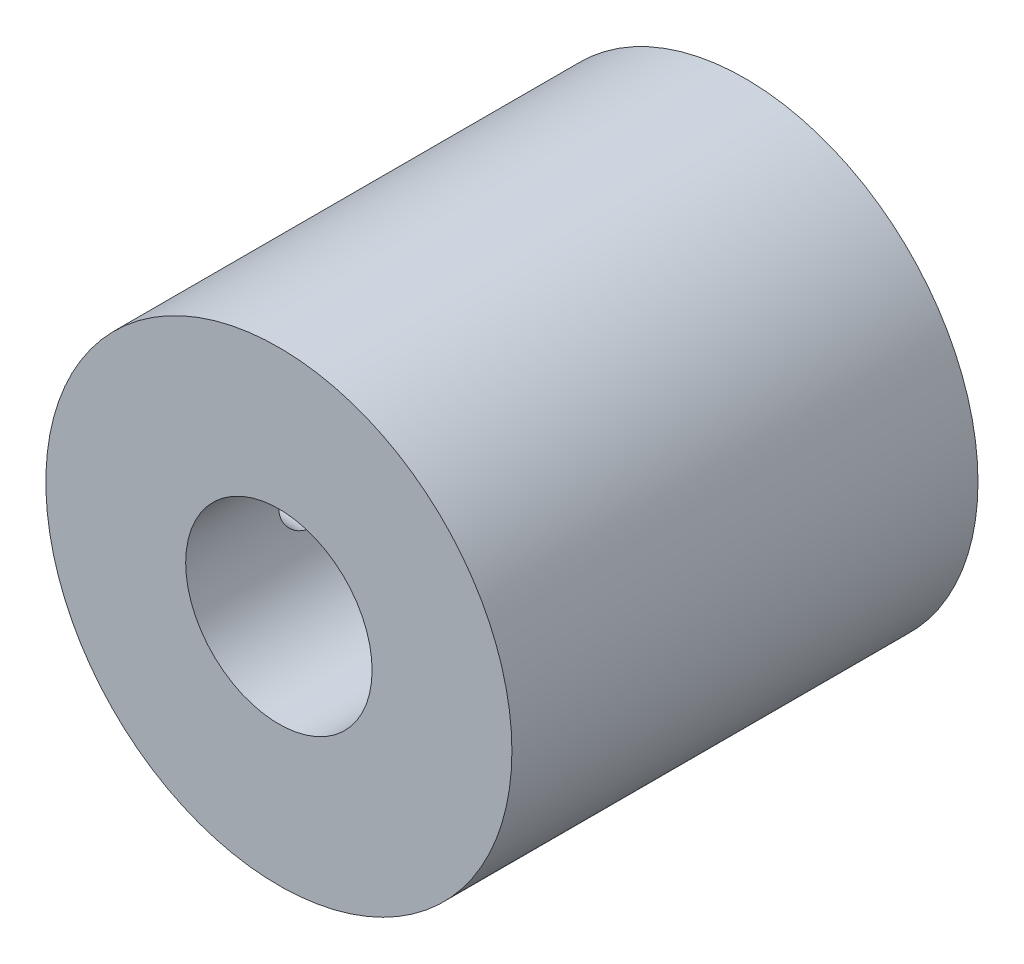
ISO-10303-21;
HEADER;
FILE_DESCRIPTION(('STEP AP214'),'2;1');
FILE_NAME('part.step','',(''),(''),'','','');
FILE_SCHEMA(('AUTOMOTIVE_DESIGN { 1 0 10303 214 1 1 1 1 }'));
ENDSEC;
DATA;
#1=APPLICATION_CONTEXT('core data for automotive mechanical design processes');
#2=APPLICATION_PROTOCOL_DEFINITION('international standard','automotive_design',2000,#1);
#3=PRODUCT_CONTEXT('',#1,'mechanical');
#4=PRODUCT('Part','Part','',(#3));
#5=PRODUCT_RELATED_PRODUCT_CATEGORY('part','',(#4));
#6=PRODUCT_DEFINITION_FORMATION('','',#4);
#7=PRODUCT_DEFINITION_CONTEXT('part definition',#1,'design');
#8=PRODUCT_DEFINITION('design','',#6,#7);
#9=PRODUCT_DEFINITION_SHAPE('','',#8);
#10=(LENGTH_UNIT() NAMED_UNIT(*) SI_UNIT(.MILLI.,.METRE.));
#11=(NAMED_UNIT(*) PLANE_ANGLE_UNIT() SI_UNIT($,.RADIAN.));
#12=(NAMED_UNIT(*) SI_UNIT($,.STERADIAN.) SOLID_ANGLE_UNIT());
#13=UNCERTAINTY_MEASURE_WITH_UNIT(LENGTH_MEASURE(1.E-05),#10,'distance_accuracy_value','');
#14=(GEOMETRIC_REPRESENTATION_CONTEXT(3) GLOBAL_UNCERTAINTY_ASSIGNED_CONTEXT((#13)) GLOBAL_UNIT_ASSIGNED_CONTEXT((#10,
#11,#12)) REPRESENTATION_CONTEXT('',''));
#15=CARTESIAN_POINT('',(0.,0.,0.));
#16=DIRECTION('',(0.,0.,1.));
#17=DIRECTION('',(1.,0.,0.));
#18=AXIS2_PLACEMENT_3D('',#15,#16,#17);
#19=CARTESIAN_POINT('',(0.,0.,12.5));
#20=DIRECTION('',(0.,0.,-1.));
#21=DIRECTION('',(-1.,0.,0.));
#22=AXIS2_PLACEMENT_3D('',#19,#20,#21);
#23=CYLINDRICAL_SURFACE('',#22,12.5);
#24=CARTESIAN_POINT('',(-12.5,0.,4.5));
#25=CARTESIAN_POINT('',(-12.499998867873,-0.0839320235538505,4.50000358197072));
#26=CARTESIAN_POINT('',(-12.4991457100204,-0.167917158665596,4.50706832934634));
#27=CARTESIAN_POINT('',(-12.495824352711,-0.333552285654126,4.53514053207769));
#28=CARTESIAN_POINT('',(-12.4933544466864,-0.415199714795035,4.55616272062529));
#29=CARTESIAN_POINT('',(-12.4870779632713,-0.573737397670265,4.61152313826301));
#30=CARTESIAN_POINT('',(-12.4832722657654,-0.650630743796125,4.64585260341209));
#31=CARTESIAN_POINT('',(-12.4747479632173,-0.797549578916002,4.72683436754165));
#32=CARTESIAN_POINT('',(-12.4700295202071,-0.86757628356758,4.77348447987666));
#33=CARTESIAN_POINT('',(-12.460180052721,-0.999145657672257,4.87803743098762));
#34=CARTESIAN_POINT('',(-12.4550472515452,-1.0606483456536,4.93599042005596));
#35=CARTESIAN_POINT('',(-12.4449619698576,-1.17307965519171,5.06139648244395));
#36=CARTESIAN_POINT('',(-12.4400094983534,-1.22400774913237,5.12885002950932));
#37=CARTESIAN_POINT('',(-12.4308280185202,-1.31399171436948,5.27160041264919));
#38=CARTESIAN_POINT('',(-12.4266012951985,-1.35301037836285,5.34692086229007));
#39=CARTESIAN_POINT('',(-12.4193730672343,-1.4178302865078,5.50310435105437));
#40=CARTESIAN_POINT('',(-12.4163715196899,-1.44363199348388,5.58396719598465));
#41=CARTESIAN_POINT('',(-12.4119503036869,-1.481164650227,5.74852642965571));
#42=CARTESIAN_POINT('',(-12.4105230726271,-1.49296288993823,5.83220726421384));
#43=CARTESIAN_POINT('',(-12.4093888845306,-1.50236187609835,6.00037246818208));
#44=CARTESIAN_POINT('',(-12.4096818635516,-1.49996315026424,6.08485680760848));
#45=CARTESIAN_POINT('',(-12.4119480733153,-1.48109158039334,6.25176298239218));
#46=CARTESIAN_POINT('',(-12.4139124717338,-1.46469271611151,6.33419331934009));
#47=CARTESIAN_POINT('',(-12.4192864043804,-1.41840173085034,6.49512351391068));
#48=CARTESIAN_POINT('',(-12.4226959657844,-1.38850935612907,6.5736232975895));
#49=CARTESIAN_POINT('',(-12.4305861039738,-1.31599990349931,6.72469473411956));
#50=CARTESIAN_POINT('',(-12.4350693931099,-1.27335053101963,6.79725073917678));
#51=CARTESIAN_POINT('',(-12.444599699395,-1.17656086584735,6.93420360545788));
#52=CARTESIAN_POINT('',(-12.4496467403106,-1.12242008861578,6.99860012245129));
#53=CARTESIAN_POINT('',(-12.4597751654319,-1.0037737778109,7.11783554218219));
#54=CARTESIAN_POINT('',(-12.464856563712,-0.93920445025608,7.17261098492853));
#55=CARTESIAN_POINT('',(-12.4744510399275,-0.801753979469361,7.27055576050016));
#56=CARTESIAN_POINT('',(-12.478964116721,-0.728872819540024,7.31372507000958));
#57=CARTESIAN_POINT('',(-12.4869159430851,-0.576819654131424,7.38723164281983));
#58=CARTESIAN_POINT('',(-12.4903543736405,-0.497645789357797,7.41756509666522));
#59=CARTESIAN_POINT('',(-12.4957665326545,-0.335278011136721,7.46448936892545));
#60=CARTESIAN_POINT('',(-12.4977403242792,-0.252084271220812,7.48108078000224));
#61=CARTESIAN_POINT('',(-12.4999926250152,-0.0845871981871093,7.49996812774885));
#62=CARTESIAN_POINT('',(-12.5002815046876,-0.000293860216026888,7.50235151620035));
#63=CARTESIAN_POINT('',(-12.4991593911616,0.167491034121629,7.49298571106587));
#64=CARTESIAN_POINT('',(-12.4977484312654,0.250982606163663,7.48123679435232));
#65=CARTESIAN_POINT('',(-12.4933916690343,0.414537131964178,7.44401251799846));
#66=CARTESIAN_POINT('',(-12.4904505118954,0.494609673184517,7.41857869347496));
#67=CARTESIAN_POINT('',(-12.4833627750896,0.649352698843229,7.35474964832321));
#68=CARTESIAN_POINT('',(-12.4792161574379,0.724023012961736,7.31635401925496));
#69=CARTESIAN_POINT('',(-12.4701542579347,0.866233588832522,7.22747854204879));
#70=CARTESIAN_POINT('',(-12.4652354042322,0.933738144813755,7.17694193109459));
#71=CARTESIAN_POINT('',(-12.455190895971,1.05933812576102,7.06529957679592));
#72=CARTESIAN_POINT('',(-12.4500652338742,1.11743320736475,7.00419344792603));
#73=CARTESIAN_POINT('',(-12.4401529742471,1.22287397613077,6.87276219228616));
#74=CARTESIAN_POINT('',(-12.4353682915654,1.27016181615969,6.80239049232808));
#75=CARTESIAN_POINT('',(-12.4267107496692,1.35224657214666,6.65465248746222));
#76=CARTESIAN_POINT('',(-12.4228378733971,1.38704372178037,6.57728631344088));
#77=CARTESIAN_POINT('',(-12.4164552867251,1.44306498334079,6.41794469555265));
#78=CARTESIAN_POINT('',(-12.4139422637816,1.46432210079673,6.33598099407031));
#79=CARTESIAN_POINT('',(-12.4105542637293,1.49276636081758,6.16961551525747));
#80=CARTESIAN_POINT('',(-12.4096792168553,1.49995410263041,6.08521384192134));
#81=CARTESIAN_POINT('',(-12.4096681633035,1.50004516908965,5.91694363518141));
#82=CARTESIAN_POINT('',(-12.4105210931972,1.49303936835675,5.83307513711437));
#83=CARTESIAN_POINT('',(-12.4138461473713,1.46513424336044,5.66771660680292));
#84=CARTESIAN_POINT('',(-12.4163182722328,1.44423491411034,5.58622657541221));
#85=CARTESIAN_POINT('',(-12.4225998262293,1.38916369910273,5.42794773055565));
#86=CARTESIAN_POINT('',(-12.4264088508406,1.35499582785269,5.35115750325226));
#87=CARTESIAN_POINT('',(-12.4349357269569,1.27436641314005,5.20438612646495));
#88=CARTESIAN_POINT('',(-12.4396535863076,1.22790476354723,5.13440503577035));
#89=CARTESIAN_POINT('',(-12.4495027561294,1.12366844823603,5.00277352994558));
#90=CARTESIAN_POINT('',(-12.4546364290673,1.06582601965075,4.94117694836686));
#91=CARTESIAN_POINT('',(-12.4647177484085,0.940610466672237,4.828528760217));
#92=CARTESIAN_POINT('',(-12.4696653505255,0.873235091318005,4.7774796511854));
#93=CARTESIAN_POINT('',(-12.4788360854662,0.730596612325683,4.68722471100057));
#94=CARTESIAN_POINT('',(-12.4830566108105,0.655306617312087,4.64806113713886));
#95=CARTESIAN_POINT('',(-12.4902709259863,0.499211375842654,4.58298811777871));
#96=CARTESIAN_POINT('',(-12.4932660590307,0.418412282181071,4.5570641519098));
#97=CARTESIAN_POINT('',(-12.4969634163,0.280988550618347,4.52546828983094));
#98=CARTESIAN_POINT('',(-12.4980966397165,0.225233284876742,4.51593125805681));
#99=CARTESIAN_POINT('',(-12.4996153102102,0.112993367846846,4.50319592825452));
#100=CARTESIAN_POINT('',(-12.5000007622246,0.0565087213768115,4.49999758837477));
#101=CARTESIAN_POINT('',(-12.5,0.,4.5));
#102=B_SPLINE_CURVE_WITH_KNOTS('',3,(#24,#25,#26,#27,#28,#29,#30,#31,#32,#33,#34,#35,#36,#37,
#38,#39,#40,#41,#42,#43,#44,#45,#46,#47,#48,#49,#50,#51,#52,#53,#54,#55,#56,#57,#58,#59,#60,#61,
#62,#63,#64,#65,#66,#67,#68,#69,#70,#71,#72,#73,#74,#75,#76,#77,#78,#79,#80,#81,#82,#83,#84,#85,
#86,#87,#88,#89,#90,#91,#92,#93,#94,#95,#96,#97,#98,#99,#100,#101),.UNSPECIFIED.,.T.,.F.,(4,2,2,
2,2,2,2,2,2,2,2,2,2,2,2,2,2,2,2,2,2,2,2,2,2,2,2,2,2,2,2,2,2,2,2,2,2,2,4),(0.,0.25158967547808,
0.503445347043117,0.7551354318778,1.00678087720846,1.25956936097939,1.51237045452442,
1.76595344748199,2.01952755999557,2.27187819171639,2.5242194433424,2.77523546456127,
3.02625620626698,3.27791786855268,3.52959014434631,3.78286472320159,4.03613981086301,
4.28949001347139,4.5428292891131,4.79460761312113,5.0463810045054,5.29739451278874,
5.54841593150834,5.80063460892782,6.05286248801783,6.30641037908359,6.5599535265315,
6.81287624132445,7.06578818330771,7.31708596596146,7.56838383881169,7.81960573856942,
8.07082980715608,8.3235976201016,8.57642521760045,8.8301414511973,9.08357882396374,
9.25296714728134,9.42235435219904),.UNSPECIFIED.);
#103=CARTESIAN_POINT('',(-12.5,0.,4.5));
#104=VERTEX_POINT('',#103);
#105=EDGE_CURVE('E54',#104,#104,#102,.T.);
#106=ORIENTED_EDGE('',*,*,#105,.F.);
#107=EDGE_LOOP('',(#106));
#108=FACE_BOUND('',#107,.T.);
#109=CARTESIAN_POINT('',(-12.5,0.,-7.5));
#110=CARTESIAN_POINT('',(-12.499998867873,-0.0839320235538483,-7.49999641802928));
#111=CARTESIAN_POINT('',(-12.4991457100204,-0.167917158665594,-7.49293167065366));
#112=CARTESIAN_POINT('',(-12.495824352711,-0.333552285654123,-7.46485946792231));
#113=CARTESIAN_POINT('',(-12.4933544466864,-0.415199714795033,-7.44383727937471));
#114=CARTESIAN_POINT('',(-12.4870779632713,-0.573737397670263,-7.38847686173699));
#115=CARTESIAN_POINT('',(-12.4832722657654,-0.650630743796122,-7.35414739658791));
#116=CARTESIAN_POINT('',(-12.4747479632173,-0.797549578915999,-7.27316563245835));
#117=CARTESIAN_POINT('',(-12.4700295202071,-0.867576283567578,-7.22651552012334));
#118=CARTESIAN_POINT('',(-12.460180052721,-0.999145657672255,-7.12196256901238));
#119=CARTESIAN_POINT('',(-12.4550472515452,-1.0606483456536,-7.06400957994404));
#120=CARTESIAN_POINT('',(-12.4449619698576,-1.17307965519171,-6.93860351755605));
#121=CARTESIAN_POINT('',(-12.4400094983534,-1.22400774913237,-6.87114997049068));
#122=CARTESIAN_POINT('',(-12.4308280185202,-1.31399171436948,-6.72839958735081));
#123=CARTESIAN_POINT('',(-12.4266012951985,-1.35301037836285,-6.65307913770993));
#124=CARTESIAN_POINT('',(-12.4193730672343,-1.4178302865078,-6.49689564894563));
#125=CARTESIAN_POINT('',(-12.4163715196899,-1.44363199348388,-6.41603280401535));
#126=CARTESIAN_POINT('',(-12.4119503036869,-1.481164650227,-6.25147357034429));
#127=CARTESIAN_POINT('',(-12.4105230726271,-1.49296288993823,-6.16779273578616));
#128=CARTESIAN_POINT('',(-12.4093888845306,-1.50236187609835,-5.99962753181792));
#129=CARTESIAN_POINT('',(-12.4096818635516,-1.49996315026424,-5.91514319239152));
#130=CARTESIAN_POINT('',(-12.4119480733153,-1.48109158039334,-5.74823701760783));
#131=CARTESIAN_POINT('',(-12.4139124717338,-1.46469271611151,-5.66580668065991));
#132=CARTESIAN_POINT('',(-12.4192864043804,-1.41840173085033,-5.50487648608932));
#133=CARTESIAN_POINT('',(-12.4226959657844,-1.38850935612907,-5.4263767024105));
#134=CARTESIAN_POINT('',(-12.4305861039738,-1.31599990349931,-5.27530526588044));
#135=CARTESIAN_POINT('',(-12.4350693931099,-1.27335053101962,-5.20274926082322));
#136=CARTESIAN_POINT('',(-12.444599699395,-1.17656086584735,-5.06579639454212));
#137=CARTESIAN_POINT('',(-12.4496467403106,-1.12242008861578,-5.00139987754871));
#138=CARTESIAN_POINT('',(-12.4597751654319,-1.0037737778109,-4.88216445781781));
#139=CARTESIAN_POINT('',(-12.464856563712,-0.939204450256078,-4.82738901507147));
#140=CARTESIAN_POINT('',(-12.4744510399275,-0.801753979469359,-4.72944423949985));
#141=CARTESIAN_POINT('',(-12.478964116721,-0.728872819540022,-4.68627492999043));
#142=CARTESIAN_POINT('',(-12.4869159430851,-0.576819654131422,-4.61276835718017));
#143=CARTESIAN_POINT('',(-12.4903543736405,-0.497645789357794,-4.58243490333478));
#144=CARTESIAN_POINT('',(-12.4957665326545,-0.335278011136719,-4.53551063107455));
#145=CARTESIAN_POINT('',(-12.4977403242792,-0.25208427122081,-4.51891921999776));
#146=CARTESIAN_POINT('',(-12.4999926250152,-0.0845871981871073,-4.50003187225115));
#147=CARTESIAN_POINT('',(-12.5002815046876,-0.000293860216024936,-4.49764848379965));
#148=CARTESIAN_POINT('',(-12.4991593911616,0.167491034121631,-4.50701428893413));
#149=CARTESIAN_POINT('',(-12.4977484312654,0.250982606163665,-4.51876320564768));
#150=CARTESIAN_POINT('',(-12.4933916690343,0.414537131964179,-4.55598748200154));
#151=CARTESIAN_POINT('',(-12.4904505118954,0.494609673184519,-4.58142130652504));
#152=CARTESIAN_POINT('',(-12.4833627750896,0.649352698843231,-4.64525035167679));
#153=CARTESIAN_POINT('',(-12.4792161574379,0.724023012961738,-4.68364598074504));
#154=CARTESIAN_POINT('',(-12.4701542579347,0.866233588832523,-4.77252145795121));
#155=CARTESIAN_POINT('',(-12.4652354042322,0.933738144813756,-4.82305806890541));
#156=CARTESIAN_POINT('',(-12.455190895971,1.05933812576102,-4.93470042320408));
#157=CARTESIAN_POINT('',(-12.4500652338742,1.11743320736475,-4.99580655207397));
#158=CARTESIAN_POINT('',(-12.4401529742471,1.22287397613077,-5.12723780771384));
#159=CARTESIAN_POINT('',(-12.4353682915654,1.2701618161597,-5.19760950767192));
#160=CARTESIAN_POINT('',(-12.4267107496692,1.35224657214666,-5.34534751253778));
#161=CARTESIAN_POINT('',(-12.4228378733971,1.38704372178037,-5.42271368655912));
#162=CARTESIAN_POINT('',(-12.4164552867251,1.4430649833408,-5.58205530444735));
#163=CARTESIAN_POINT('',(-12.4139422637816,1.46432210079673,-5.66401900592969));
#164=CARTESIAN_POINT('',(-12.4105542637293,1.49276636081758,-5.83038448474253));
#165=CARTESIAN_POINT('',(-12.4096792168553,1.49995410263041,-5.91478615807866));
#166=CARTESIAN_POINT('',(-12.4096681633035,1.50004516908966,-6.08305636481859));
#167=CARTESIAN_POINT('',(-12.4105210931972,1.49303936835676,-6.16692486288563));
#168=CARTESIAN_POINT('',(-12.4138461473713,1.46513424336045,-6.33228339319708));
#169=CARTESIAN_POINT('',(-12.4163182722328,1.44423491411034,-6.41377342458779));
#170=CARTESIAN_POINT('',(-12.4225998262293,1.38916369910273,-6.57205226944435));
#171=CARTESIAN_POINT('',(-12.4264088508406,1.3549958278527,-6.64884249674774));
#172=CARTESIAN_POINT('',(-12.4349357269569,1.27436641314005,-6.79561387353505));
#173=CARTESIAN_POINT('',(-12.4396535863076,1.22790476354723,-6.86559496422965));
#174=CARTESIAN_POINT('',(-12.4495027561294,1.12366844823603,-6.99722647005442));
#175=CARTESIAN_POINT('',(-12.4546364290673,1.06582601965075,-7.05882305163314));
#176=CARTESIAN_POINT('',(-12.4647177484085,0.940610466672239,-7.171471239783));
#177=CARTESIAN_POINT('',(-12.4696653505255,0.873235091318007,-7.2225203488146));
#178=CARTESIAN_POINT('',(-12.4788360854662,0.730596612325686,-7.31277528899943));
#179=CARTESIAN_POINT('',(-12.4830566108105,0.65530661731209,-7.35193886286114));
#180=CARTESIAN_POINT('',(-12.4902709259863,0.499211375842658,-7.41701188222129));
#181=CARTESIAN_POINT('',(-12.4932660590307,0.418412282181075,-7.44293584809019));
#182=CARTESIAN_POINT('',(-12.4969634163,0.280988550618351,-7.47453171016906));
#183=CARTESIAN_POINT('',(-12.4980966397165,0.225233284876746,-7.48406874194319));
#184=CARTESIAN_POINT('',(-12.4996153102102,0.112993367846849,-7.49680407174548));
#185=CARTESIAN_POINT('',(-12.5000007622246,0.0565087213768143,-7.50000241162523));
#186=CARTESIAN_POINT('',(-12.5,0.,-7.5));
#187=B_SPLINE_CURVE_WITH_KNOTS('',3,(#109,#110,#111,#112,#113,#114,#115,#116,#117,#118,#119,
#120,#121,#122,#123,#124,#125,#126,#127,#128,#129,#130,#131,#132,#133,#134,#135,#136,#137,#138,
#139,#140,#141,#142,#143,#144,#145,#146,#147,#148,#149,#150,#151,#152,#153,#154,#155,#156,#157,
#158,#159,#160,#161,#162,#163,#164,#165,#166,#167,#168,#169,#170,#171,#172,#173,#174,#175,#176,
#177,#178,#179,#180,#181,#182,#183,#184,#185,#186),.UNSPECIFIED.,.T.,.F.,(4,2,2,2,2,2,2,2,2,2,2,
2,2,2,2,2,2,2,2,2,2,2,2,2,2,2,2,2,2,2,2,2,2,2,2,2,2,2,4),(0.,0.25158967547808,0.503445347043117,
0.7551354318778,1.00678087720846,1.25956936097939,1.51237045452442,1.76595344748199,
2.01952755999557,2.27187819171639,2.5242194433424,2.77523546456127,3.02625620626698,
3.27791786855268,3.52959014434631,3.78286472320159,4.03613981086301,4.28949001347139,
4.5428292891131,4.79460761312113,5.0463810045054,5.29739451278874,5.54841593150834,
5.80063460892782,6.05286248801783,6.30641037908359,6.5599535265315,6.81287624132445,
7.06578818330771,7.31708596596146,7.56838383881169,7.81960573856942,8.07082980715608,
8.3235976201016,8.57642521760046,8.8301414511973,9.08357882396374,9.25296714728134,
9.42235435219904),.UNSPECIFIED.);
#188=CARTESIAN_POINT('',(-12.5,0.,-7.5));
#189=VERTEX_POINT('',#188);
#190=EDGE_CURVE('E66',#189,#189,#187,.T.);
#191=ORIENTED_EDGE('',*,*,#190,.F.);
#192=EDGE_LOOP('',(#191));
#193=FACE_BOUND('',#192,.T.);
#194=CARTESIAN_POINT('',(0.,0.,12.5));
#195=DIRECTION('',(0.,0.,1.));
#196=DIRECTION('',(1.,0.,0.));
#197=AXIS2_PLACEMENT_3D('',#194,#195,#196);
#198=CIRCLE('',#197,12.5);
#199=CARTESIAN_POINT('',(12.5,0.,12.5));
#200=VERTEX_POINT('',#199);
#201=EDGE_CURVE('E10',#200,#200,#198,.T.);
#202=ORIENTED_EDGE('',*,*,#201,.F.);
#203=EDGE_LOOP('',(#202));
#204=FACE_BOUND('',#203,.T.);
#205=CARTESIAN_POINT('',(0.,0.,-12.5));
#206=DIRECTION('',(0.,0.,1.));
#207=DIRECTION('',(1.,0.,0.));
#208=AXIS2_PLACEMENT_3D('',#205,#206,#207);
#209=CIRCLE('',#208,12.5);
#210=CARTESIAN_POINT('',(12.5,0.,-12.5));
#211=VERTEX_POINT('',#210);
#212=EDGE_CURVE('E42',#211,#211,#209,.T.);
#213=ORIENTED_EDGE('',*,*,#212,.T.);
#214=EDGE_LOOP('',(#213));
#215=FACE_BOUND('',#214,.T.);
#216=ADVANCED_FACE('F39',(#108,#193,#204,#215),#23,.T.);
#217=CARTESIAN_POINT('',(0.,0.,12.5));
#218=DIRECTION('',(0.,0.,1.));
#219=DIRECTION('',(1.,0.,0.));
#220=AXIS2_PLACEMENT_3D('',#217,#218,#219);
#221=PLANE('',#220);
#222=CARTESIAN_POINT('',(0.,0.,12.5));
#223=DIRECTION('',(0.,0.,1.));
#224=DIRECTION('',(1.,0.,0.));
#225=AXIS2_PLACEMENT_3D('',#222,#223,#224);
#226=CIRCLE('',#225,5.);
#227=CARTESIAN_POINT('',(5.,0.,12.5));
#228=VERTEX_POINT('',#227);
#229=EDGE_CURVE('E51',#228,#228,#226,.T.);
#230=ORIENTED_EDGE('',*,*,#229,.F.);
#231=EDGE_LOOP('',(#230));
#232=FACE_BOUND('',#231,.T.);
#233=ORIENTED_EDGE('',*,*,#201,.T.);
#234=EDGE_LOOP('',(#233));
#235=FACE_BOUND('',#234,.T.);
#236=ADVANCED_FACE('F83',(#232,#235),#221,.T.);
#237=CARTESIAN_POINT('',(0.,0.,-12.5));
#238=DIRECTION('',(0.,0.,1.));
#239=DIRECTION('',(1.,0.,0.));
#240=AXIS2_PLACEMENT_3D('',#237,#238,#239);
#241=PLANE('',#240);
#242=CARTESIAN_POINT('',(0.,0.,-12.5));
#243=DIRECTION('',(0.,0.,1.));
#244=DIRECTION('',(1.,0.,0.));
#245=AXIS2_PLACEMENT_3D('',#242,#243,#244);
#246=CIRCLE('',#245,5.);
#247=CARTESIAN_POINT('',(5.,0.,-12.5));
#248=VERTEX_POINT('',#247);
#249=EDGE_CURVE('E49',#248,#248,#246,.T.);
#250=ORIENTED_EDGE('',*,*,#249,.T.);
#251=EDGE_LOOP('',(#250));
#252=FACE_BOUND('',#251,.T.);
#253=ORIENTED_EDGE('',*,*,#212,.F.);
#254=EDGE_LOOP('',(#253));
#255=FACE_BOUND('',#254,.T.);
#256=ADVANCED_FACE('F81',(#252,#255),#241,.F.);
#257=CARTESIAN_POINT('',(0.,0.,-12.5));
#258=DIRECTION('',(0.,0.,1.));
#259=DIRECTION('',(1.,0.,0.));
#260=AXIS2_PLACEMENT_3D('',#257,#258,#259);
#261=CYLINDRICAL_SURFACE('',#260,5.);
#262=CARTESIAN_POINT('',(-5.,0.,4.5));
#263=CARTESIAN_POINT('',(-4.9999992925055,0.0822886127532992,4.50000099748489));
#264=CARTESIAN_POINT('',(-4.99794915693954,0.164587318351529,4.50679386362397));
#265=CARTESIAN_POINT('',(-4.98997105593691,0.32678812530488,4.5337213542221));
#266=CARTESIAN_POINT('',(-4.98404193389692,0.406689504411419,4.55385995802334));
#267=CARTESIAN_POINT('',(-4.96895552501836,0.561732707754526,4.60674601691026));
#268=CARTESIAN_POINT('',(-4.95980300250425,0.636881364395372,4.63947486961894));
#269=CARTESIAN_POINT('',(-4.93922109237645,0.78062418105313,4.71653609305584));
#270=CARTESIAN_POINT('',(-4.92779140192067,0.849217467469668,4.76087000739542));
#271=CARTESIAN_POINT('',(-4.90350737192774,0.979871797183745,4.86122400747267));
#272=CARTESIAN_POINT('',(-4.89062383657036,1.04171807124434,4.91751662588591));
#273=CARTESIAN_POINT('',(-4.86505834210442,1.15524920923324,5.03960922991018));
#274=CARTESIAN_POINT('',(-4.85237641724501,1.20693236327441,5.10541081212496));
#275=CARTESIAN_POINT('',(-4.82834113993772,1.29980037723708,5.24647075303761));
#276=CARTESIAN_POINT('',(-4.81702406663875,1.34072309022213,5.32190846099074));
#277=CARTESIAN_POINT('',(-4.79743620394031,1.4092139477476,5.47898925423029));
#278=CARTESIAN_POINT('',(-4.78916468313311,1.43678529919973,5.56063084392798));
#279=CARTESIAN_POINT('',(-4.77690870838434,1.47701633682652,5.72539026613046));
#280=CARTESIAN_POINT('',(-4.77281069324533,1.49007196234677,5.80840274386394));
#281=CARTESIAN_POINT('',(-4.76902789749767,1.50213730614672,5.97553315621677));
#282=CARTESIAN_POINT('',(-4.76934204760571,1.50115042761078,6.05965081805909));
#283=CARTESIAN_POINT('',(-4.77424744067778,1.48546977199812,6.22338390860848));
#284=CARTESIAN_POINT('',(-4.7786838859914,1.47127205262685,6.30305225036224));
#285=CARTESIAN_POINT('',(-4.79108356228624,1.43037420427056,6.45881978627346));
#286=CARTESIAN_POINT('',(-4.79904714132351,1.40367284141641,6.53491862737433));
#287=CARTESIAN_POINT('',(-4.81772733074973,1.33816026653682,6.68260034966074));
#288=CARTESIAN_POINT('',(-4.82848016115952,1.29918816934642,6.75410708395526));
#289=CARTESIAN_POINT('',(-4.85150987000065,1.21035222588683,6.88973202201019));
#290=CARTESIAN_POINT('',(-4.86378711746991,1.16048574002588,6.95384842941378));
#291=CARTESIAN_POINT('',(-4.88911011297937,1.04881290765546,7.07568619076202));
#292=CARTESIAN_POINT('',(-4.90216654310498,0.986594907466971,7.13302866402967));
#293=CARTESIAN_POINT('',(-4.92712244063259,0.853263259313966,7.23655398406425));
#294=CARTESIAN_POINT('',(-4.9390218351841,0.782149051860887,7.28273612841443));
#295=CARTESIAN_POINT('',(-4.9604316006947,0.632355038342803,7.36285992246473));
#296=CARTESIAN_POINT('',(-4.96992543668314,0.55362774974795,7.39671751624986));
#297=CARTESIAN_POINT('',(-4.98533521832222,0.391245415603519,7.45059959009963));
#298=CARTESIAN_POINT('',(-4.99125216186999,0.307591751589581,7.47062792853249));
#299=CARTESIAN_POINT('',(-4.99868364643538,0.140952242668331,7.4956521778994));
#300=CARTESIAN_POINT('',(-5.0003485041779,0.0580500976011868,7.50116158580161));
#301=CARTESIAN_POINT('',(-4.9995292324176,-0.107499605823383,7.49843084428792));
#302=CARTESIAN_POINT('',(-4.99704565677756,-0.190147196690781,7.49019253034856));
#303=CARTESIAN_POINT('',(-4.98830696987163,-0.350903605309697,7.46061538888851));
#304=CARTESIAN_POINT('',(-4.98213829799417,-0.42907277261417,7.43957661241913));
#305=CARTESIAN_POINT('',(-4.96674347841533,-0.580754638954523,7.3853567672218));
#306=CARTESIAN_POINT('',(-4.95751696321085,-0.654266777025585,7.35217423896214));
#307=CARTESIAN_POINT('',(-4.93669654351325,-0.796437189461053,7.27374683451887));
#308=CARTESIAN_POINT('',(-4.92505280829675,-0.864943826199671,7.22824065905203));
#309=CARTESIAN_POINT('',(-4.90073468764317,-0.993523307980148,7.12677524594719));
#310=CARTESIAN_POINT('',(-4.8880600443108,-1.05359403235594,7.07081338811233));
#311=CARTESIAN_POINT('',(-4.86253171869138,-1.16585744551027,6.94761269163066));
#312=CARTESIAN_POINT('',(-4.84968825033268,-1.21768481231504,6.88003812422826));
#313=CARTESIAN_POINT('',(-4.82576515238463,-1.30928995072154,6.73687206098647));
#314=CARTESIAN_POINT('',(-4.81468547654651,-1.34906803829472,6.66128077544179));
#315=CARTESIAN_POINT('',(-4.79567189615055,-1.41517347127168,6.50446750874531));
#316=CARTESIAN_POINT('',(-4.78772337843827,-1.4415634693705,6.42327381346341));
#317=CARTESIAN_POINT('',(-4.77591594362794,-1.48021730815114,6.25731203106852));
#318=CARTESIAN_POINT('',(-4.772055625083,-1.49248598978779,6.17254517921233));
#319=CARTESIAN_POINT('',(-4.76899972496087,-1.50221984485059,6.00563848162377));
#320=CARTESIAN_POINT('',(-4.76961647442754,-1.5002805530849,5.92353634898241));
#321=CARTESIAN_POINT('',(-4.77499401288294,-1.48307505444814,5.7608858966272));
#322=CARTESIAN_POINT('',(-4.77975463592551,-1.46780938124716,5.68033751482365));
#323=CARTESIAN_POINT('',(-4.79275763670386,-1.42476888804136,5.52405460085715));
#324=CARTESIAN_POINT('',(-4.80095604545965,-1.39715175507069,5.44827271263831));
#325=CARTESIAN_POINT('',(-4.81990278909136,-1.33031507121129,5.30235756118228));
#326=CARTESIAN_POINT('',(-4.83065161194312,-1.29109329962876,5.23222538235924));
#327=CARTESIAN_POINT('',(-4.85397676425833,-1.20048763805072,5.09683688347289));
#328=CARTESIAN_POINT('',(-4.86660540163798,-1.14871276092994,5.03185123873959));
#329=CARTESIAN_POINT('',(-4.89201320450026,-1.03517434629782,4.91129750169214));
#330=CARTESIAN_POINT('',(-4.90479240823905,-0.973408217134502,4.85573186053224));
#331=CARTESIAN_POINT('',(-4.92950936570649,-0.839465762183249,4.75397658770497));
#332=CARTESIAN_POINT('',(-4.94141159765674,-0.767037885790609,4.70810855314451));
#333=CARTESIAN_POINT('',(-4.96260680455813,-0.61514137398353,4.62926483009598));
#334=CARTESIAN_POINT('',(-4.97190099931067,-0.535676052998956,4.59628311172549));
#335=CARTESIAN_POINT('',(-4.98602174969301,-0.380757712655282,4.54710472434725));
#336=CARTESIAN_POINT('',(-4.99122027381068,-0.305786961954235,4.52948832711675));
#337=CARTESIAN_POINT('',(-4.99820944494492,-0.15388019523078,4.50593647475842));
#338=CARTESIAN_POINT('',(-5.0000006615474,-0.0769445098581403,4.49999906729518));
#339=CARTESIAN_POINT('',(-5.,0.,4.5));
#340=B_SPLINE_CURVE_WITH_KNOTS('',3,(#262,#263,#264,#265,#266,#267,#268,#269,#270,#271,#272,
#273,#274,#275,#276,#277,#278,#279,#280,#281,#282,#283,#284,#285,#286,#287,#288,#289,#290,#291,
#292,#293,#294,#295,#296,#297,#298,#299,#300,#301,#302,#303,#304,#305,#306,#307,#308,#309,#310,
#311,#312,#313,#314,#315,#316,#317,#318,#319,#320,#321,#322,#323,#324,#325,#326,#327,#328,#329,
#330,#331,#332,#333,#334,#335,#336,#337,#338,#339),.UNSPECIFIED.,.T.,.F.,(4,2,2,2,2,2,2,2,2,2,2,
2,2,2,2,2,2,2,2,2,2,2,2,2,2,2,2,2,2,2,2,2,2,2,2,2,2,2,4),(0.,0.246583203612611,0.493239964846,
0.739533676300874,0.985860164412701,1.23855602948191,1.49129437288633,1.74971481004109,
2.00807314543224,2.25919689356599,2.51025978319089,2.75226016697676,2.99428443658001,
3.2396242644712,3.48502360158556,3.74067104048167,3.99633456531072,4.25371046881689,
4.51101453528808,4.75908809438545,5.00712853550327,5.24956746682327,5.49203554593729,
5.74011305702908,5.98825282000191,6.24540400322818,6.50254844252681,6.75847814951252,
7.01432009460283,7.25950155466943,7.504673196616,7.74680040402721,7.98897397553107,
8.23996925679931,8.49102974897503,8.74942996156671,9.00770911595235,9.2383169193046,
9.46888616948875),.UNSPECIFIED.);
#341=CARTESIAN_POINT('',(-5.,0.,4.5));
#342=VERTEX_POINT('',#341);
#343=EDGE_CURVE('E65',#342,#342,#340,.T.);
#344=ORIENTED_EDGE('',*,*,#343,.F.);
#345=EDGE_LOOP('',(#344));
#346=FACE_BOUND('',#345,.T.);
#347=CARTESIAN_POINT('',(-5.,0.,-7.5));
#348=CARTESIAN_POINT('',(-4.9999992925055,0.0822886127533014,-7.49999900251511));
#349=CARTESIAN_POINT('',(-4.99794915693954,0.164587318351531,-7.49320613637603));
#350=CARTESIAN_POINT('',(-4.98997105593691,0.326788125304882,-7.4662786457779));
#351=CARTESIAN_POINT('',(-4.98404193389692,0.406689504411421,-7.44614004197666));
#352=CARTESIAN_POINT('',(-4.96895552501836,0.561732707754528,-7.39325398308974));
#353=CARTESIAN_POINT('',(-4.95980300250425,0.636881364395374,-7.36052513038106));
#354=CARTESIAN_POINT('',(-4.93922109237645,0.780624181053133,-7.28346390694416));
#355=CARTESIAN_POINT('',(-4.92779140192067,0.849217467469671,-7.23912999260458));
#356=CARTESIAN_POINT('',(-4.90350737192774,0.979871797183747,-7.13877599252733));
#357=CARTESIAN_POINT('',(-4.89062383657036,1.04171807124434,-7.08248337411409));
#358=CARTESIAN_POINT('',(-4.86505834210442,1.15524920923324,-6.96039077008982));
#359=CARTESIAN_POINT('',(-4.85237641724501,1.20693236327441,-6.89458918787504));
#360=CARTESIAN_POINT('',(-4.82834113993772,1.29980037723708,-6.75352924696239));
#361=CARTESIAN_POINT('',(-4.81702406663875,1.34072309022214,-6.67809153900926));
#362=CARTESIAN_POINT('',(-4.79743620394031,1.40921394774761,-6.52101074576971));
#363=CARTESIAN_POINT('',(-4.78916468313311,1.43678529919973,-6.43936915607202));
#364=CARTESIAN_POINT('',(-4.77690870838434,1.47701633682652,-6.27460973386954));
#365=CARTESIAN_POINT('',(-4.77281069324533,1.49007196234678,-6.19159725613606));
#366=CARTESIAN_POINT('',(-4.76902789749767,1.50213730614672,-6.02446684378323));
#367=CARTESIAN_POINT('',(-4.76934204760571,1.50115042761078,-5.94034918194091));
#368=CARTESIAN_POINT('',(-4.77424744067778,1.48546977199812,-5.77661609139152));
#369=CARTESIAN_POINT('',(-4.77868388599141,1.47127205262685,-5.69694774963776));
#370=CARTESIAN_POINT('',(-4.79108356228624,1.43037420427056,-5.54118021372654));
#371=CARTESIAN_POINT('',(-4.7990471413235,1.40367284141641,-5.46508137262567));
#372=CARTESIAN_POINT('',(-4.81772733074973,1.33816026653682,-5.31739965033926));
#373=CARTESIAN_POINT('',(-4.82848016115952,1.29918816934643,-5.24589291604474));
#374=CARTESIAN_POINT('',(-4.85150987000064,1.21035222588684,-5.11026797798981));
#375=CARTESIAN_POINT('',(-4.86378711746991,1.16048574002589,-5.04615157058622));
#376=CARTESIAN_POINT('',(-4.88911011297937,1.04881290765547,-4.92431380923798));
#377=CARTESIAN_POINT('',(-4.90216654310498,0.986594907466973,-4.86697133597033));
#378=CARTESIAN_POINT('',(-4.92712244063258,0.853263259313968,-4.76344601593575));
#379=CARTESIAN_POINT('',(-4.9390218351841,0.782149051860889,-4.71726387158557));
#380=CARTESIAN_POINT('',(-4.9604316006947,0.632355038342805,-4.63714007753527));
#381=CARTESIAN_POINT('',(-4.96992543668314,0.553627749747952,-4.60328248375014));
#382=CARTESIAN_POINT('',(-4.98533521832222,0.391245415603521,-4.54940040990037));
#383=CARTESIAN_POINT('',(-4.99125216186999,0.307591751589583,-4.52937207146751));
#384=CARTESIAN_POINT('',(-4.99868364643538,0.140952242668333,-4.50434782210061));
#385=CARTESIAN_POINT('',(-5.0003485041779,0.058050097601188,-4.49883841419839));
#386=CARTESIAN_POINT('',(-4.9995292324176,-0.107499605823382,-4.50156915571208));
#387=CARTESIAN_POINT('',(-4.99704565677756,-0.19014719669078,-4.50980746965144));
#388=CARTESIAN_POINT('',(-4.98830696987163,-0.350903605309696,-4.53938461111149));
#389=CARTESIAN_POINT('',(-4.98213829799417,-0.429072772614168,-4.56042338758087));
#390=CARTESIAN_POINT('',(-4.96674347841533,-0.580754638954521,-4.6146432327782));
#391=CARTESIAN_POINT('',(-4.95751696321085,-0.654266777025583,-4.64782576103786));
#392=CARTESIAN_POINT('',(-4.93669654351325,-0.796437189461052,-4.72625316548113));
#393=CARTESIAN_POINT('',(-4.92505280829675,-0.864943826199669,-4.77175934094797));
#394=CARTESIAN_POINT('',(-4.90073468764318,-0.993523307980146,-4.87322475405281));
#395=CARTESIAN_POINT('',(-4.8880600443108,-1.05359403235593,-4.92918661188767));
#396=CARTESIAN_POINT('',(-4.86253171869138,-1.16585744551027,-5.05238730836934));
#397=CARTESIAN_POINT('',(-4.84968825033268,-1.21768481231503,-5.11996187577174));
#398=CARTESIAN_POINT('',(-4.82576515238463,-1.30928995072153,-5.26312793901353));
#399=CARTESIAN_POINT('',(-4.81468547654651,-1.34906803829472,-5.33871922455821));
#400=CARTESIAN_POINT('',(-4.79567189615055,-1.41517347127168,-5.49553249125469));
#401=CARTESIAN_POINT('',(-4.78772337843827,-1.4415634693705,-5.57672618653659));
#402=CARTESIAN_POINT('',(-4.77591594362794,-1.48021730815114,-5.74268796893148));
#403=CARTESIAN_POINT('',(-4.772055625083,-1.49248598978779,-5.82745482078767));
#404=CARTESIAN_POINT('',(-4.76899972496087,-1.50221984485059,-5.99436151837623));
#405=CARTESIAN_POINT('',(-4.76961647442754,-1.5002805530849,-6.07646365101759));
#406=CARTESIAN_POINT('',(-4.77499401288294,-1.48307505444813,-6.2391141033728));
#407=CARTESIAN_POINT('',(-4.77975463592551,-1.46780938124716,-6.31966248517635));
#408=CARTESIAN_POINT('',(-4.79275763670386,-1.42476888804136,-6.47594539914285));
#409=CARTESIAN_POINT('',(-4.80095604545965,-1.39715175507068,-6.55172728736169));
#410=CARTESIAN_POINT('',(-4.81990278909136,-1.33031507121129,-6.69764243881772));
#411=CARTESIAN_POINT('',(-4.83065161194312,-1.29109329962876,-6.76777461764076));
#412=CARTESIAN_POINT('',(-4.85397676425833,-1.20048763805072,-6.90316311652711));
#413=CARTESIAN_POINT('',(-4.86660540163798,-1.14871276092994,-6.96814876126041));
#414=CARTESIAN_POINT('',(-4.89201320450026,-1.03517434629782,-7.08870249830786));
#415=CARTESIAN_POINT('',(-4.90479240823905,-0.9734082171345,-7.14426813946776));
#416=CARTESIAN_POINT('',(-4.92950936570649,-0.839465762183247,-7.24602341229503));
#417=CARTESIAN_POINT('',(-4.94141159765674,-0.767037885790606,-7.29189144685549));
#418=CARTESIAN_POINT('',(-4.96260680455813,-0.615141373983527,-7.37073516990403));
#419=CARTESIAN_POINT('',(-4.97190099931066,-0.535676052998953,-7.40371688827451));
#420=CARTESIAN_POINT('',(-4.98602174969301,-0.38075771265528,-7.45289527565275));
#421=CARTESIAN_POINT('',(-4.99122027381068,-0.305786961954233,-7.47051167288325));
#422=CARTESIAN_POINT('',(-4.99820944494492,-0.153880195230778,-7.49406352524158));
#423=CARTESIAN_POINT('',(-5.0000006615474,-0.0769445098581381,-7.50000093270482));
#424=CARTESIAN_POINT('',(-5.,0.,-7.5));
#425=B_SPLINE_CURVE_WITH_KNOTS('',3,(#347,#348,#349,#350,#351,#352,#353,#354,#355,#356,#357,
#358,#359,#360,#361,#362,#363,#364,#365,#366,#367,#368,#369,#370,#371,#372,#373,#374,#375,#376,
#377,#378,#379,#380,#381,#382,#383,#384,#385,#386,#387,#388,#389,#390,#391,#392,#393,#394,#395,
#396,#397,#398,#399,#400,#401,#402,#403,#404,#405,#406,#407,#408,#409,#410,#411,#412,#413,#414,
#415,#416,#417,#418,#419,#420,#421,#422,#423,#424),.UNSPECIFIED.,.T.,.F.,(4,2,2,2,2,2,2,2,2,2,2,
2,2,2,2,2,2,2,2,2,2,2,2,2,2,2,2,2,2,2,2,2,2,2,2,2,2,2,4),(0.,0.246583203612611,0.493239964846,
0.739533676300874,0.985860164412702,1.23855602948191,1.49129437288633,1.74971481004109,
2.00807314543224,2.25919689356599,2.51025978319089,2.75226016697676,2.99428443658001,
3.2396242644712,3.48502360158556,3.74067104048167,3.99633456531072,4.25371046881689,
4.51101453528808,4.75908809438545,5.00712853550327,5.24956746682327,5.49203554593729,
5.74011305702909,5.98825282000191,6.24540400322819,6.50254844252681,6.75847814951252,
7.01432009460283,7.25950155466943,7.504673196616,7.74680040402721,7.98897397553108,
8.23996925679931,8.49102974897503,8.74942996156671,9.00770911595236,9.2383169193046,
9.46888616948875),.UNSPECIFIED.);
#426=CARTESIAN_POINT('',(-5.,0.,-7.5));
#427=VERTEX_POINT('',#426);
#428=EDGE_CURVE('E57',#427,#427,#425,.T.);
#429=ORIENTED_EDGE('',*,*,#428,.F.);
#430=EDGE_LOOP('',(#429));
#431=FACE_BOUND('',#430,.T.);
#432=ORIENTED_EDGE('',*,*,#249,.F.);
#433=EDGE_LOOP('',(#432));
#434=FACE_BOUND('',#433,.T.);
#435=ORIENTED_EDGE('',*,*,#229,.T.);
#436=EDGE_LOOP('',(#435));
#437=FACE_BOUND('',#436,.T.);
#438=ADVANCED_FACE('F78',(#346,#431,#434,#437),#261,.F.);
#439=CARTESIAN_POINT('',(-12.501,0.,-6.));
#440=DIRECTION('',(1.,0.,0.));
#441=DIRECTION('',(0.,0.,-1.));
#442=AXIS2_PLACEMENT_3D('',#439,#440,#441);
#443=CYLINDRICAL_SURFACE('',#442,1.5);
#444=ORIENTED_EDGE('',*,*,#428,.T.);
#445=EDGE_LOOP('',(#444));
#446=FACE_BOUND('',#445,.T.);
#447=ORIENTED_EDGE('',*,*,#190,.T.);
#448=EDGE_LOOP('',(#447));
#449=FACE_BOUND('',#448,.T.);
#450=ADVANCED_FACE('F72',(#446,#449),#443,.F.);
#451=CARTESIAN_POINT('',(-12.501,0.,6.));
#452=DIRECTION('',(1.,0.,0.));
#453=DIRECTION('',(0.,0.,-1.));
#454=AXIS2_PLACEMENT_3D('',#451,#452,#453);
#455=CYLINDRICAL_SURFACE('',#454,1.5);
#456=ORIENTED_EDGE('',*,*,#343,.T.);
#457=EDGE_LOOP('',(#456));
#458=FACE_BOUND('',#457,.T.);
#459=ORIENTED_EDGE('',*,*,#105,.T.);
#460=EDGE_LOOP('',(#459));
#461=FACE_BOUND('',#460,.T.);
#462=ADVANCED_FACE('F105',(#458,#461),#455,.F.);
#463=CLOSED_SHELL('',(#216,#236,#256,#438,#450,#462));
#464=MANIFOLD_SOLID_BREP('B2',#463);
#465=ADVANCED_BREP_SHAPE_REPRESENTATION('',(#18,#464),#14);
#466=SHAPE_DEFINITION_REPRESENTATION(#9,#465);
ENDSEC;
END-ISO-10303-21;
